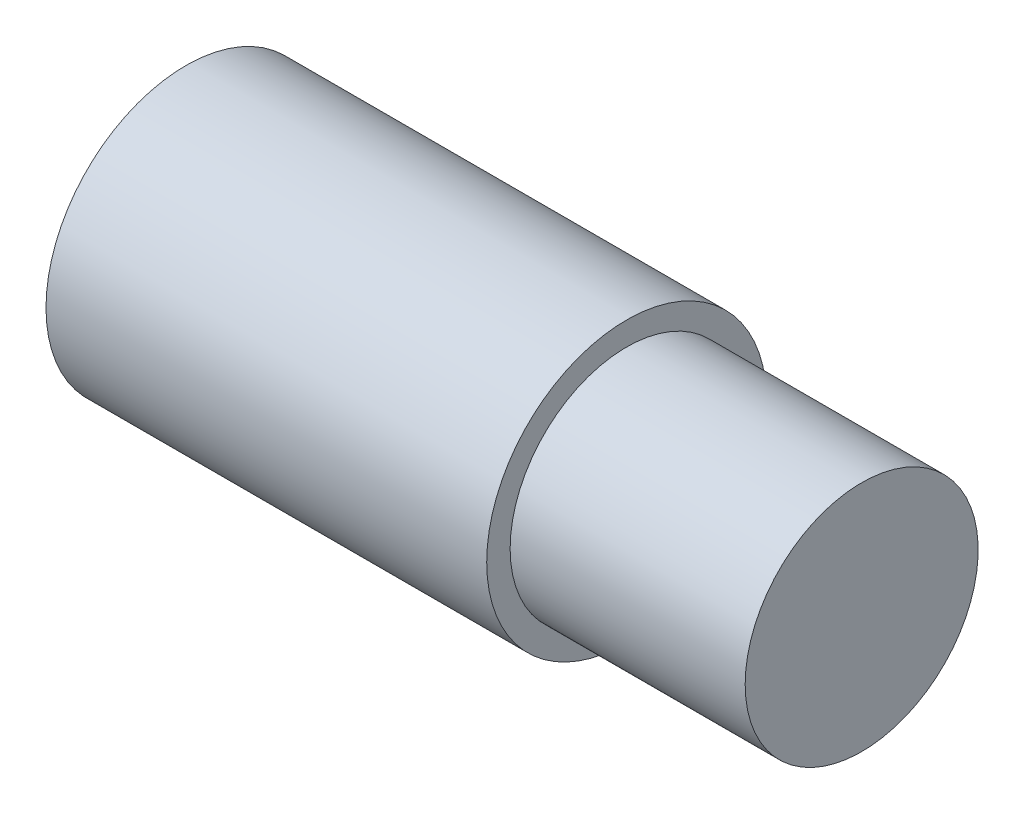
ISO-10303-21;
HEADER;
FILE_DESCRIPTION(('STEP AP214'),'2;1');
FILE_NAME('part.step','',(''),(''),'','','');
FILE_SCHEMA(('AUTOMOTIVE_DESIGN { 1 0 10303 214 1 1 1 1 }'));
ENDSEC;
DATA;
#1=APPLICATION_CONTEXT('core data for automotive mechanical design processes');
#2=APPLICATION_PROTOCOL_DEFINITION('international standard','automotive_design',2000,#1);
#3=PRODUCT_CONTEXT('',#1,'mechanical');
#4=PRODUCT('Part','Part','',(#3));
#5=PRODUCT_RELATED_PRODUCT_CATEGORY('part','',(#4));
#6=PRODUCT_DEFINITION_FORMATION('','',#4);
#7=PRODUCT_DEFINITION_CONTEXT('part definition',#1,'design');
#8=PRODUCT_DEFINITION('design','',#6,#7);
#9=PRODUCT_DEFINITION_SHAPE('','',#8);
#10=(LENGTH_UNIT() NAMED_UNIT(*) SI_UNIT(.MILLI.,.METRE.));
#11=(NAMED_UNIT(*) PLANE_ANGLE_UNIT() SI_UNIT($,.RADIAN.));
#12=(NAMED_UNIT(*) SI_UNIT($,.STERADIAN.) SOLID_ANGLE_UNIT());
#13=UNCERTAINTY_MEASURE_WITH_UNIT(LENGTH_MEASURE(1.E-05),#10,'distance_accuracy_value','');
#14=(GEOMETRIC_REPRESENTATION_CONTEXT(3) GLOBAL_UNCERTAINTY_ASSIGNED_CONTEXT((#13)) GLOBAL_UNIT_ASSIGNED_CONTEXT((#10,
#11,#12)) REPRESENTATION_CONTEXT('',''));
#15=CARTESIAN_POINT('',(0.,0.,0.));
#16=DIRECTION('',(0.,0.,1.));
#17=DIRECTION('',(1.,0.,0.));
#18=AXIS2_PLACEMENT_3D('',#15,#16,#17);
#19=CARTESIAN_POINT('',(0.,0.,0.));
#20=DIRECTION('',(1.,0.,0.));
#21=DIRECTION('',(0.,0.,-1.));
#22=AXIS2_PLACEMENT_3D('',#19,#20,#21);
#23=PLANE('',#22);
#24=CARTESIAN_POINT('',(0.,0.,0.));
#25=DIRECTION('',(-1.,0.,0.));
#26=DIRECTION('',(0.,0.,1.));
#27=AXIS2_PLACEMENT_3D('',#24,#25,#26);
#28=CIRCLE('',#27,4.7625);
#29=CARTESIAN_POINT('',(0.,0.,4.7625));
#30=VERTEX_POINT('',#29);
#31=EDGE_CURVE('E10',#30,#30,#28,.T.);
#32=ORIENTED_EDGE('',*,*,#31,.T.);
#33=EDGE_LOOP('',(#32));
#34=FACE_BOUND('',#33,.T.);
#35=ADVANCED_FACE('F28',(#34),#23,.F.);
#36=CARTESIAN_POINT('',(-58.0551980078249,0.,0.));
#37=DIRECTION('',(-1.,0.,0.));
#38=DIRECTION('',(0.,0.,1.));
#39=AXIS2_PLACEMENT_3D('',#36,#37,#38);
#40=CYLINDRICAL_SURFACE('',#39,4.7625);
#41=ORIENTED_EDGE('',*,*,#31,.F.);
#42=EDGE_LOOP('',(#41));
#43=FACE_BOUND('',#42,.T.);
#44=CARTESIAN_POINT('',(15.,0.,0.));
#45=DIRECTION('',(-1.,0.,0.));
#46=DIRECTION('',(0.,0.,1.));
#47=AXIS2_PLACEMENT_3D('',#44,#45,#46);
#48=CIRCLE('',#47,4.7625);
#49=CARTESIAN_POINT('',(15.,0.,4.7625));
#50=VERTEX_POINT('',#49);
#51=EDGE_CURVE('E34',#50,#50,#48,.T.);
#52=ORIENTED_EDGE('',*,*,#51,.T.);
#53=EDGE_LOOP('',(#52));
#54=FACE_BOUND('',#53,.T.);
#55=ADVANCED_FACE('F60',(#43,#54),#40,.T.);
#56=CARTESIAN_POINT('',(15.,4.7625,0.));
#57=DIRECTION('',(-1.,0.,0.));
#58=DIRECTION('',(0.,0.,1.));
#59=AXIS2_PLACEMENT_3D('',#56,#57,#58);
#60=PLANE('',#59);
#61=ORIENTED_EDGE('',*,*,#51,.F.);
#62=EDGE_LOOP('',(#61));
#63=FACE_BOUND('',#62,.T.);
#64=CARTESIAN_POINT('',(15.,0.,0.));
#65=DIRECTION('',(-1.,0.,0.));
#66=DIRECTION('',(0.,0.,1.));
#67=AXIS2_PLACEMENT_3D('',#64,#65,#66);
#68=CIRCLE('',#67,3.965);
#69=CARTESIAN_POINT('',(15.,0.,3.965));
#70=VERTEX_POINT('',#69);
#71=EDGE_CURVE('E38',#70,#70,#68,.T.);
#72=ORIENTED_EDGE('',*,*,#71,.T.);
#73=EDGE_LOOP('',(#72));
#74=FACE_BOUND('',#73,.T.);
#75=ADVANCED_FACE('F56',(#63,#74),#60,.F.);
#76=CARTESIAN_POINT('',(-58.0551980078249,0.,0.));
#77=DIRECTION('',(-1.,0.,0.));
#78=DIRECTION('',(0.,0.,1.));
#79=AXIS2_PLACEMENT_3D('',#76,#77,#78);
#80=CYLINDRICAL_SURFACE('',#79,3.965);
#81=ORIENTED_EDGE('',*,*,#71,.F.);
#82=EDGE_LOOP('',(#81));
#83=FACE_BOUND('',#82,.T.);
#84=CARTESIAN_POINT('',(23.,0.,0.));
#85=DIRECTION('',(-1.,0.,0.));
#86=DIRECTION('',(0.,0.,1.));
#87=AXIS2_PLACEMENT_3D('',#84,#85,#86);
#88=CIRCLE('',#87,3.965);
#89=CARTESIAN_POINT('',(23.,0.,3.965));
#90=VERTEX_POINT('',#89);
#91=EDGE_CURVE('E42',#90,#90,#88,.T.);
#92=ORIENTED_EDGE('',*,*,#91,.T.);
#93=EDGE_LOOP('',(#92));
#94=FACE_BOUND('',#93,.T.);
#95=ADVANCED_FACE('F48',(#83,#94),#80,.T.);
#96=CARTESIAN_POINT('',(23.,3.965,0.));
#97=DIRECTION('',(-1.,0.,0.));
#98=DIRECTION('',(0.,0.,1.));
#99=AXIS2_PLACEMENT_3D('',#96,#97,#98);
#100=PLANE('',#99);
#101=ORIENTED_EDGE('',*,*,#91,.F.);
#102=EDGE_LOOP('',(#101));
#103=FACE_BOUND('',#102,.T.);
#104=ADVANCED_FACE('F50',(#103),#100,.F.);
#105=CLOSED_SHELL('',(#35,#55,#75,#95,#104));
#106=MANIFOLD_SOLID_BREP('B2',#105);
#107=ADVANCED_BREP_SHAPE_REPRESENTATION('',(#18,#106),#14);
#108=SHAPE_DEFINITION_REPRESENTATION(#9,#107);
ENDSEC;
END-ISO-10303-21;
